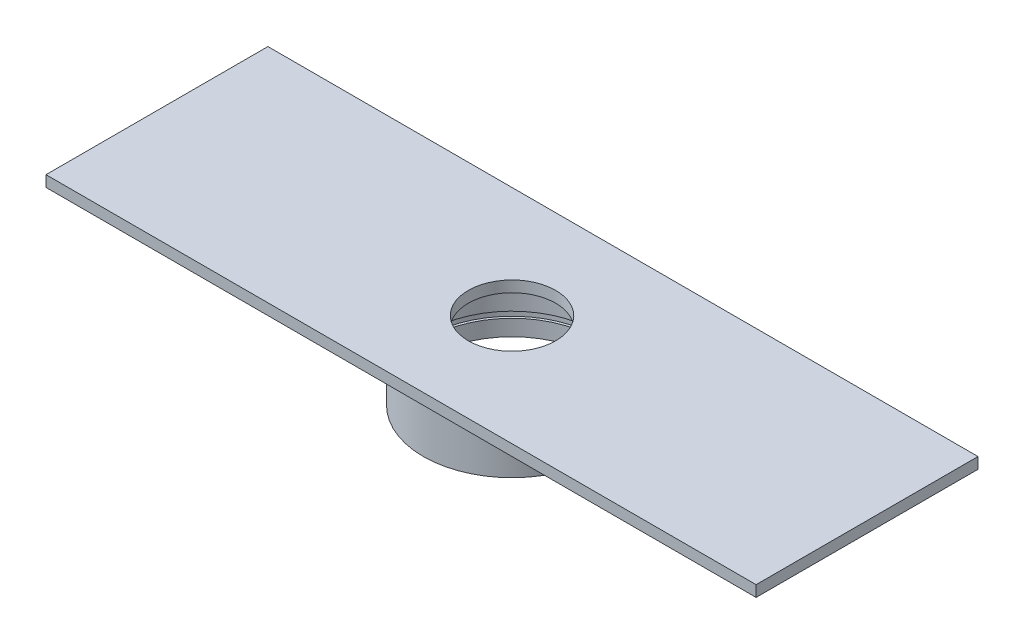
ISO-10303-21;
HEADER;
FILE_DESCRIPTION(('STEP AP214'),'2;1');
FILE_NAME('part.step','',(''),(''),'','','');
FILE_SCHEMA(('AUTOMOTIVE_DESIGN { 1 0 10303 214 1 1 1 1 }'));
ENDSEC;
DATA;
#1=APPLICATION_CONTEXT('core data for automotive mechanical design processes');
#2=APPLICATION_PROTOCOL_DEFINITION('international standard','automotive_design',2000,#1);
#3=PRODUCT_CONTEXT('',#1,'mechanical');
#4=PRODUCT('Part','Part','',(#3));
#5=PRODUCT_RELATED_PRODUCT_CATEGORY('part','',(#4));
#6=PRODUCT_DEFINITION_FORMATION('','',#4);
#7=PRODUCT_DEFINITION_CONTEXT('part definition',#1,'design');
#8=PRODUCT_DEFINITION('design','',#6,#7);
#9=PRODUCT_DEFINITION_SHAPE('','',#8);
#10=(LENGTH_UNIT() NAMED_UNIT(*) SI_UNIT(.MILLI.,.METRE.));
#11=(NAMED_UNIT(*) PLANE_ANGLE_UNIT() SI_UNIT($,.RADIAN.));
#12=(NAMED_UNIT(*) SI_UNIT($,.STERADIAN.) SOLID_ANGLE_UNIT());
#13=UNCERTAINTY_MEASURE_WITH_UNIT(LENGTH_MEASURE(1.E-05),#10,'distance_accuracy_value','');
#14=(GEOMETRIC_REPRESENTATION_CONTEXT(3) GLOBAL_UNCERTAINTY_ASSIGNED_CONTEXT((#13)) GLOBAL_UNIT_ASSIGNED_CONTEXT((#10,
#11,#12)) REPRESENTATION_CONTEXT('',''));
#15=CARTESIAN_POINT('',(0.,0.,0.));
#16=DIRECTION('',(0.,0.,1.));
#17=DIRECTION('',(1.,0.,0.));
#18=AXIS2_PLACEMENT_3D('',#15,#16,#17);
#19=CARTESIAN_POINT('',(0.,19.05,0.));
#20=DIRECTION('',(0.,-1.,0.));
#21=DIRECTION('',(0.,0.,-1.));
#22=AXIS2_PLACEMENT_3D('',#19,#20,#21);
#23=CYLINDRICAL_SURFACE('',#22,24.);
#24=CARTESIAN_POINT('',(0.,19.05,0.));
#25=DIRECTION('',(0.,1.,0.));
#26=DIRECTION('',(0.,0.,1.));
#27=AXIS2_PLACEMENT_3D('',#24,#25,#26);
#28=CIRCLE('',#27,24.);
#29=CARTESIAN_POINT('',(0.,19.05,24.));
#30=VERTEX_POINT('',#29);
#31=EDGE_CURVE('E118',#30,#30,#28,.T.);
#32=ORIENTED_EDGE('',*,*,#31,.T.);
#33=EDGE_LOOP('',(#32));
#34=FACE_BOUND('',#33,.T.);
#35=CARTESIAN_POINT('',(0.,6.35,0.));
#36=DIRECTION('',(0.,-1.,0.));
#37=DIRECTION('',(1.,0.,0.));
#38=AXIS2_PLACEMENT_3D('',#35,#36,#37);
#39=CIRCLE('',#38,24.);
#40=CARTESIAN_POINT('',(24.,6.34999999999983,0.));
#41=VERTEX_POINT('',#40);
#42=EDGE_CURVE('E122',#41,#41,#39,.T.);
#43=ORIENTED_EDGE('',*,*,#42,.T.);
#44=EDGE_LOOP('',(#43));
#45=FACE_BOUND('',#44,.T.);
#46=ADVANCED_FACE('F37',(#34,#45),#23,.F.);
#47=CARTESIAN_POINT('',(0.,0.,0.));
#48=DIRECTION('',(0.,1.,0.));
#49=DIRECTION('',(0.,0.,1.));
#50=AXIS2_PLACEMENT_3D('',#47,#48,#49);
#51=PLANE('',#50);
#52=CARTESIAN_POINT('',(0.,0.,0.));
#53=DIRECTION('',(0.,1.,0.));
#54=DIRECTION('',(0.,0.,1.));
#55=AXIS2_PLACEMENT_3D('',#52,#53,#54);
#56=CIRCLE('',#55,25.4);
#57=CARTESIAN_POINT('',(0.,0.,25.4));
#58=VERTEX_POINT('',#57);
#59=EDGE_CURVE('E47',#58,#58,#56,.T.);
#60=ORIENTED_EDGE('',*,*,#59,.F.);
#61=EDGE_LOOP('',(#60));
#62=FACE_BOUND('',#61,.T.);
#63=CARTESIAN_POINT('',(0.,0.,0.));
#64=DIRECTION('',(0.,1.,0.));
#65=DIRECTION('',(0.,0.,1.));
#66=AXIS2_PLACEMENT_3D('',#63,#64,#65);
#67=CIRCLE('',#66,24.);
#68=CARTESIAN_POINT('',(0.,0.,24.));
#69=VERTEX_POINT('',#68);
#70=EDGE_CURVE('E128',#69,#69,#67,.T.);
#71=ORIENTED_EDGE('',*,*,#70,.T.);
#72=EDGE_LOOP('',(#71));
#73=FACE_BOUND('',#72,.T.);
#74=ADVANCED_FACE('F148',(#62,#73),#51,.F.);
#75=CARTESIAN_POINT('',(0.,19.05,0.));
#76=DIRECTION('',(0.,-1.,0.));
#77=DIRECTION('',(0.,0.,-1.));
#78=AXIS2_PLACEMENT_3D('',#75,#76,#77);
#79=CYLINDRICAL_SURFACE('',#78,25.4);
#80=CARTESIAN_POINT('',(0.,19.05,0.));
#81=DIRECTION('',(0.,1.,0.));
#82=DIRECTION('',(0.,0.,1.));
#83=AXIS2_PLACEMENT_3D('',#80,#81,#82);
#84=CIRCLE('',#83,25.4);
#85=CARTESIAN_POINT('',(0.,19.05,25.4));
#86=VERTEX_POINT('',#85);
#87=EDGE_CURVE('E11',#86,#86,#84,.T.);
#88=ORIENTED_EDGE('',*,*,#87,.F.);
#89=EDGE_LOOP('',(#88));
#90=FACE_BOUND('',#89,.T.);
#91=ORIENTED_EDGE('',*,*,#59,.T.);
#92=EDGE_LOOP('',(#91));
#93=FACE_BOUND('',#92,.T.);
#94=ADVANCED_FACE('F39',(#90,#93),#79,.T.);
#95=CARTESIAN_POINT('',(0.,4.6,0.));
#96=DIRECTION('',(0.,-1.,0.));
#97=DIRECTION('',(1.,0.,0.));
#98=AXIS2_PLACEMENT_3D('',#95,#96,#97);
#99=CIRCLE('',#98,24.);
#100=CARTESIAN_POINT('',(24.,4.59999999999983,0.));
#101=VERTEX_POINT('',#100);
#102=EDGE_CURVE('E41',#101,#101,#99,.T.);
#103=ORIENTED_EDGE('',*,*,#102,.F.);
#104=EDGE_LOOP('',(#103));
#105=FACE_BOUND('',#104,.T.);
#106=ORIENTED_EDGE('',*,*,#70,.F.);
#107=EDGE_LOOP('',(#106));
#108=FACE_BOUND('',#107,.T.);
#109=ADVANCED_FACE('F141',(#105,#108),#23,.F.);
#110=CARTESIAN_POINT('',(0.,4.6,0.));
#111=DIRECTION('',(0.,1.,0.));
#112=DIRECTION('',(-1.,0.,0.));
#113=AXIS2_PLACEMENT_3D('',#110,#111,#112);
#114=CYLINDRICAL_SURFACE('',#113,24.7000000000001);
#115=CARTESIAN_POINT('',(0.,4.6,0.));
#116=DIRECTION('',(0.,-1.,0.));
#117=DIRECTION('',(1.,0.,0.));
#118=AXIS2_PLACEMENT_3D('',#115,#116,#117);
#119=CIRCLE('',#118,24.7000000000001);
#120=CARTESIAN_POINT('',(24.7000000000001,4.59999999999983,0.));
#121=VERTEX_POINT('',#120);
#122=EDGE_CURVE('E119',#121,#121,#119,.T.);
#123=ORIENTED_EDGE('',*,*,#122,.T.);
#124=EDGE_LOOP('',(#123));
#125=FACE_BOUND('',#124,.T.);
#126=CARTESIAN_POINT('',(0.,6.35,0.));
#127=DIRECTION('',(0.,-1.,0.));
#128=DIRECTION('',(1.,0.,0.));
#129=AXIS2_PLACEMENT_3D('',#126,#127,#128);
#130=CIRCLE('',#129,24.7000000000001);
#131=CARTESIAN_POINT('',(24.7000000000001,6.34999999999983,0.));
#132=VERTEX_POINT('',#131);
#133=EDGE_CURVE('E123',#132,#132,#130,.T.);
#134=ORIENTED_EDGE('',*,*,#133,.F.);
#135=EDGE_LOOP('',(#134));
#136=FACE_BOUND('',#135,.T.);
#137=ADVANCED_FACE('F144',(#125,#136),#114,.F.);
#138=CARTESIAN_POINT('',(0.,4.6,0.));
#139=DIRECTION('',(0.,-1.,0.));
#140=DIRECTION('',(1.,0.,0.));
#141=AXIS2_PLACEMENT_3D('',#138,#139,#140);
#142=PLANE('',#141);
#143=ORIENTED_EDGE('',*,*,#102,.T.);
#144=EDGE_LOOP('',(#143));
#145=FACE_BOUND('',#144,.T.);
#146=ORIENTED_EDGE('',*,*,#122,.F.);
#147=EDGE_LOOP('',(#146));
#148=FACE_BOUND('',#147,.T.);
#149=ADVANCED_FACE('F138',(#145,#148),#142,.F.);
#150=CARTESIAN_POINT('',(0.,6.35,0.));
#151=DIRECTION('',(0.,-1.,0.));
#152=DIRECTION('',(1.,0.,0.));
#153=AXIS2_PLACEMENT_3D('',#150,#151,#152);
#154=PLANE('',#153);
#155=ORIENTED_EDGE('',*,*,#42,.F.);
#156=EDGE_LOOP('',(#155));
#157=FACE_BOUND('',#156,.T.);
#158=ORIENTED_EDGE('',*,*,#133,.T.);
#159=EDGE_LOOP('',(#158));
#160=FACE_BOUND('',#159,.T.);
#161=ADVANCED_FACE('F162',(#157,#160),#154,.T.);
#162=CARTESIAN_POINT('',(0.,19.05,0.));
#163=DIRECTION('',(0.,1.,0.));
#164=DIRECTION('',(0.,0.,1.));
#165=AXIS2_PLACEMENT_3D('',#162,#163,#164);
#166=PLANE('',#165);
#167=CARTESIAN_POINT('',(0.,19.05,0.));
#168=DIRECTION('',(0.,1.,0.));
#169=DIRECTION('',(0.,0.,1.));
#170=AXIS2_PLACEMENT_3D('',#167,#168,#169);
#171=CIRCLE('',#170,12.5);
#172=CARTESIAN_POINT('',(0.,19.05,12.5));
#173=VERTEX_POINT('',#172);
#174=EDGE_CURVE('E196',#173,#173,#171,.T.);
#175=ORIENTED_EDGE('',*,*,#174,.T.);
#176=EDGE_LOOP('',(#175));
#177=FACE_BOUND('',#176,.T.);
#178=ORIENTED_EDGE('',*,*,#31,.F.);
#179=EDGE_LOOP('',(#178));
#180=FACE_BOUND('',#179,.T.);
#181=ADVANCED_FACE('F165',(#177,#180),#166,.F.);
#182=CARTESIAN_POINT('',(0.,22.225,0.));
#183=DIRECTION('',(0.,1.,0.));
#184=DIRECTION('',(0.,0.,1.));
#185=AXIS2_PLACEMENT_3D('',#182,#183,#184);
#186=PLANE('',#185);
#187=DIRECTION('',(-1.,0.,0.));
#188=VECTOR('',#187,1.);
#189=CARTESIAN_POINT('',(101.6,22.225,-31.75));
#190=LINE('',#189,#188);
#191=CARTESIAN_POINT('',(101.6,22.225,-31.75));
#192=VERTEX_POINT('',#191);
#193=CARTESIAN_POINT('',(-101.6,22.225,-31.75));
#194=VERTEX_POINT('',#193);
#195=EDGE_CURVE('E93',#192,#194,#190,.T.);
#196=ORIENTED_EDGE('',*,*,#195,.T.);
#197=DIRECTION('',(0.,0.,1.));
#198=VECTOR('',#197,1.);
#199=CARTESIAN_POINT('',(-101.6,22.225,-31.75));
#200=LINE('',#199,#198);
#201=CARTESIAN_POINT('',(-101.6,22.225,31.75));
#202=VERTEX_POINT('',#201);
#203=EDGE_CURVE('E87',#194,#202,#200,.T.);
#204=ORIENTED_EDGE('',*,*,#203,.T.);
#205=DIRECTION('',(1.,0.,0.));
#206=VECTOR('',#205,1.);
#207=CARTESIAN_POINT('',(-101.6,22.225,31.75));
#208=LINE('',#207,#206);
#209=CARTESIAN_POINT('',(101.6,22.225,31.75));
#210=VERTEX_POINT('',#209);
#211=EDGE_CURVE('E91',#202,#210,#208,.T.);
#212=ORIENTED_EDGE('',*,*,#211,.T.);
#213=DIRECTION('',(0.,0.,-1.));
#214=VECTOR('',#213,1.);
#215=CARTESIAN_POINT('',(101.6,22.225,31.75));
#216=LINE('',#215,#214);
#217=EDGE_CURVE('E56',#210,#192,#216,.T.);
#218=ORIENTED_EDGE('',*,*,#217,.T.);
#219=EDGE_LOOP('',(#196,#204,#212,#218));
#220=FACE_BOUND('',#219,.T.);
#221=CARTESIAN_POINT('',(0.,22.225,0.));
#222=DIRECTION('',(0.,1.,0.));
#223=DIRECTION('',(0.,0.,1.));
#224=AXIS2_PLACEMENT_3D('',#221,#222,#223);
#225=CIRCLE('',#224,12.5);
#226=CARTESIAN_POINT('',(0.,22.225,12.5));
#227=VERTEX_POINT('',#226);
#228=EDGE_CURVE('E111',#227,#227,#225,.T.);
#229=ORIENTED_EDGE('',*,*,#228,.F.);
#230=EDGE_LOOP('',(#229));
#231=FACE_BOUND('',#230,.T.);
#232=ADVANCED_FACE('F88',(#220,#231),#186,.T.);
#233=ORIENTED_EDGE('',*,*,#87,.T.);
#234=EDGE_LOOP('',(#233));
#235=FACE_BOUND('',#234,.T.);
#236=DIRECTION('',(-1.,0.,0.));
#237=VECTOR('',#236,1.);
#238=CARTESIAN_POINT('',(101.6,19.05,-31.75));
#239=LINE('',#238,#237);
#240=CARTESIAN_POINT('',(101.6,19.05,-31.75));
#241=VERTEX_POINT('',#240);
#242=CARTESIAN_POINT('',(-101.6,19.05,-31.75));
#243=VERTEX_POINT('',#242);
#244=EDGE_CURVE('E108',#241,#243,#239,.T.);
#245=ORIENTED_EDGE('',*,*,#244,.F.);
#246=DIRECTION('',(0.,0.,-1.));
#247=VECTOR('',#246,1.);
#248=CARTESIAN_POINT('',(101.6,19.05,31.75));
#249=LINE('',#248,#247);
#250=CARTESIAN_POINT('',(101.6,19.05,31.75));
#251=VERTEX_POINT('',#250);
#252=EDGE_CURVE('E79',#251,#241,#249,.T.);
#253=ORIENTED_EDGE('',*,*,#252,.F.);
#254=DIRECTION('',(1.,0.,0.));
#255=VECTOR('',#254,1.);
#256=CARTESIAN_POINT('',(-101.6,19.05,31.75));
#257=LINE('',#256,#255);
#258=CARTESIAN_POINT('',(-101.6,19.05,31.75));
#259=VERTEX_POINT('',#258);
#260=EDGE_CURVE('E73',#259,#251,#257,.T.);
#261=ORIENTED_EDGE('',*,*,#260,.F.);
#262=DIRECTION('',(0.,0.,1.));
#263=VECTOR('',#262,1.);
#264=CARTESIAN_POINT('',(-101.6,19.05,-31.75));
#265=LINE('',#264,#263);
#266=EDGE_CURVE('E98',#243,#259,#265,.T.);
#267=ORIENTED_EDGE('',*,*,#266,.F.);
#268=EDGE_LOOP('',(#245,#253,#261,#267));
#269=FACE_BOUND('',#268,.T.);
#270=ADVANCED_FACE('F172',(#235,#269),#166,.F.);
#271=CARTESIAN_POINT('',(101.6,22.225,-31.75));
#272=DIRECTION('',(0.,0.,1.));
#273=DIRECTION('',(1.,0.,0.));
#274=AXIS2_PLACEMENT_3D('',#271,#272,#273);
#275=PLANE('',#274);
#276=ORIENTED_EDGE('',*,*,#244,.T.);
#277=DIRECTION('',(0.,-1.,0.));
#278=VECTOR('',#277,1.);
#279=CARTESIAN_POINT('',(-101.6,22.225,-31.75));
#280=LINE('',#279,#278);
#281=EDGE_CURVE('E99',#194,#243,#280,.T.);
#282=ORIENTED_EDGE('',*,*,#281,.F.);
#283=ORIENTED_EDGE('',*,*,#195,.F.);
#284=DIRECTION('',(0.,-1.,0.));
#285=VECTOR('',#284,1.);
#286=CARTESIAN_POINT('',(101.6,22.225,-31.75));
#287=LINE('',#286,#285);
#288=EDGE_CURVE('E104',#192,#241,#287,.T.);
#289=ORIENTED_EDGE('',*,*,#288,.T.);
#290=EDGE_LOOP('',(#276,#282,#283,#289));
#291=FACE_BOUND('',#290,.T.);
#292=ADVANCED_FACE('F169',(#291),#275,.F.);
#293=CARTESIAN_POINT('',(-101.6,22.225,-31.75));
#294=DIRECTION('',(1.,0.,0.));
#295=DIRECTION('',(0.,0.,-1.));
#296=AXIS2_PLACEMENT_3D('',#293,#294,#295);
#297=PLANE('',#296);
#298=ORIENTED_EDGE('',*,*,#266,.T.);
#299=DIRECTION('',(0.,-1.,0.));
#300=VECTOR('',#299,1.);
#301=CARTESIAN_POINT('',(-101.6,22.225,31.75));
#302=LINE('',#301,#300);
#303=EDGE_CURVE('E96',#202,#259,#302,.T.);
#304=ORIENTED_EDGE('',*,*,#303,.F.);
#305=ORIENTED_EDGE('',*,*,#203,.F.);
#306=ORIENTED_EDGE('',*,*,#281,.T.);
#307=EDGE_LOOP('',(#298,#304,#305,#306));
#308=FACE_BOUND('',#307,.T.);
#309=ADVANCED_FACE('F97',(#308),#297,.F.);
#310=CARTESIAN_POINT('',(-101.6,22.225,31.75));
#311=DIRECTION('',(0.,0.,-1.));
#312=DIRECTION('',(-1.,0.,0.));
#313=AXIS2_PLACEMENT_3D('',#310,#311,#312);
#314=PLANE('',#313);
#315=ORIENTED_EDGE('',*,*,#260,.T.);
#316=DIRECTION('',(0.,-1.,0.));
#317=VECTOR('',#316,1.);
#318=CARTESIAN_POINT('',(101.6,22.225,31.75));
#319=LINE('',#318,#317);
#320=EDGE_CURVE('E100',#210,#251,#319,.T.);
#321=ORIENTED_EDGE('',*,*,#320,.F.);
#322=ORIENTED_EDGE('',*,*,#211,.F.);
#323=ORIENTED_EDGE('',*,*,#303,.T.);
#324=EDGE_LOOP('',(#315,#321,#322,#323));
#325=FACE_BOUND('',#324,.T.);
#326=ADVANCED_FACE('F102',(#325),#314,.F.);
#327=CARTESIAN_POINT('',(101.6,22.225,31.75));
#328=DIRECTION('',(-1.,0.,0.));
#329=DIRECTION('',(0.,0.,1.));
#330=AXIS2_PLACEMENT_3D('',#327,#328,#329);
#331=PLANE('',#330);
#332=ORIENTED_EDGE('',*,*,#252,.T.);
#333=ORIENTED_EDGE('',*,*,#288,.F.);
#334=ORIENTED_EDGE('',*,*,#217,.F.);
#335=ORIENTED_EDGE('',*,*,#320,.T.);
#336=EDGE_LOOP('',(#332,#333,#334,#335));
#337=FACE_BOUND('',#336,.T.);
#338=ADVANCED_FACE('F178',(#337),#331,.F.);
#339=CARTESIAN_POINT('',(0.,22.225,0.));
#340=DIRECTION('',(0.,-1.,0.));
#341=DIRECTION('',(0.,0.,-1.));
#342=AXIS2_PLACEMENT_3D('',#339,#340,#341);
#343=CYLINDRICAL_SURFACE('',#342,12.5);
#344=ORIENTED_EDGE('',*,*,#228,.T.);
#345=EDGE_LOOP('',(#344));
#346=FACE_BOUND('',#345,.T.);
#347=ORIENTED_EDGE('',*,*,#174,.F.);
#348=EDGE_LOOP('',(#347));
#349=FACE_BOUND('',#348,.T.);
#350=ADVANCED_FACE('F181',(#346,#349),#343,.F.);
#351=CLOSED_SHELL('',(#46,#74,#94,#109,#137,#149,#161,#181,#232,#270,#292,#309,#326,#338,#350));
#352=MANIFOLD_SOLID_BREP('B2',#351);
#353=ADVANCED_BREP_SHAPE_REPRESENTATION('',(#18,#352),#14);
#354=SHAPE_DEFINITION_REPRESENTATION(#9,#353);
ENDSEC;
END-ISO-10303-21;
